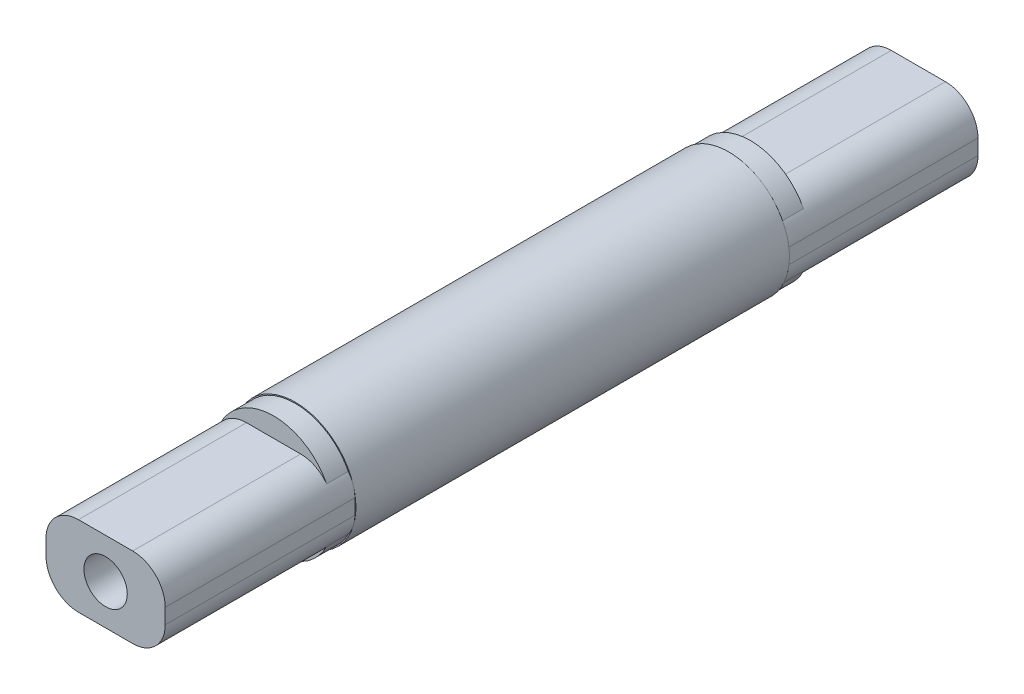
ISO-10303-21;
HEADER;
FILE_DESCRIPTION(('STEP AP214'),'2;1');
FILE_NAME('part.step','',(''),(''),'','','');
FILE_SCHEMA(('AUTOMOTIVE_DESIGN { 1 0 10303 214 1 1 1 1 }'));
ENDSEC;
DATA;
#1=APPLICATION_CONTEXT('core data for automotive mechanical design processes');
#2=APPLICATION_PROTOCOL_DEFINITION('international standard','automotive_design',2000,#1);
#3=PRODUCT_CONTEXT('',#1,'mechanical');
#4=PRODUCT('Part','Part','',(#3));
#5=PRODUCT_RELATED_PRODUCT_CATEGORY('part','',(#4));
#6=PRODUCT_DEFINITION_FORMATION('','',#4);
#7=PRODUCT_DEFINITION_CONTEXT('part definition',#1,'design');
#8=PRODUCT_DEFINITION('design','',#6,#7);
#9=PRODUCT_DEFINITION_SHAPE('','',#8);
#10=(LENGTH_UNIT() NAMED_UNIT(*) SI_UNIT(.MILLI.,.METRE.));
#11=(NAMED_UNIT(*) PLANE_ANGLE_UNIT() SI_UNIT($,.RADIAN.));
#12=(NAMED_UNIT(*) SI_UNIT($,.STERADIAN.) SOLID_ANGLE_UNIT());
#13=UNCERTAINTY_MEASURE_WITH_UNIT(LENGTH_MEASURE(1.E-05),#10,'distance_accuracy_value','');
#14=(GEOMETRIC_REPRESENTATION_CONTEXT(3) GLOBAL_UNCERTAINTY_ASSIGNED_CONTEXT((#13)) GLOBAL_UNIT_ASSIGNED_CONTEXT((#10,
#11,#12)) REPRESENTATION_CONTEXT('',''));
#15=CARTESIAN_POINT('',(0.,0.,0.));
#16=DIRECTION('',(0.,0.,1.));
#17=DIRECTION('',(1.,0.,0.));
#18=AXIS2_PLACEMENT_3D('',#15,#16,#17);
#19=CARTESIAN_POINT('',(0.,7.1,11.));
#20=DIRECTION('',(0.,0.,1.));
#21=DIRECTION('',(1.,0.,0.));
#22=AXIS2_PLACEMENT_3D('',#19,#20,#21);
#23=PLANE('',#22);
#24=CARTESIAN_POINT('',(0.,7.1,11.));
#25=DIRECTION('',(0.,0.,1.));
#26=DIRECTION('',(1.,0.,0.));
#27=AXIS2_PLACEMENT_3D('',#24,#25,#26);
#28=CIRCLE('',#27,1.);
#29=CARTESIAN_POINT('',(1.,7.1,11.));
#30=VERTEX_POINT('',#29);
#31=EDGE_CURVE('E14',#30,#30,#28,.T.);
#32=ORIENTED_EDGE('',*,*,#31,.T.);
#33=EDGE_LOOP('',(#32));
#34=FACE_BOUND('',#33,.T.);
#35=ADVANCED_FACE('F62',(#34),#23,.T.);
#36=CARTESIAN_POINT('',(0.,7.1,18.75));
#37=DIRECTION('',(0.,0.,-1.));
#38=DIRECTION('',(-1.,0.,0.));
#39=AXIS2_PLACEMENT_3D('',#36,#37,#38);
#40=CYLINDRICAL_SURFACE('',#39,1.);
#41=ORIENTED_EDGE('',*,*,#31,.F.);
#42=EDGE_LOOP('',(#41));
#43=FACE_BOUND('',#42,.T.);
#44=CARTESIAN_POINT('',(0.,7.1,18.75));
#45=DIRECTION('',(0.,0.,1.));
#46=DIRECTION('',(1.,0.,0.));
#47=AXIS2_PLACEMENT_3D('',#44,#45,#46);
#48=CIRCLE('',#47,1.);
#49=CARTESIAN_POINT('',(1.,7.1,18.75));
#50=VERTEX_POINT('',#49);
#51=EDGE_CURVE('E342',#50,#50,#48,.T.);
#52=ORIENTED_EDGE('',*,*,#51,.T.);
#53=EDGE_LOOP('',(#52));
#54=FACE_BOUND('',#53,.T.);
#55=ADVANCED_FACE('F657',(#43,#54),#40,.F.);
#56=DIRECTION('',(-1.,0.,0.));
#57=VECTOR('',#56,1.);
#58=CARTESIAN_POINT('',(2.75,8.95,11.));
#59=LINE('',#58,#57);
#60=CARTESIAN_POINT('',(1.25,8.95,11.));
#61=VERTEX_POINT('',#60);
#62=CARTESIAN_POINT('',(-1.25,8.95,11.));
#63=VERTEX_POINT('',#62);
#64=EDGE_CURVE('E549',#61,#63,#59,.T.);
#65=ORIENTED_EDGE('',*,*,#64,.F.);
#66=CARTESIAN_POINT('',(1.25,7.45,11.));
#67=DIRECTION('',(0.,0.,1.));
#68=DIRECTION('',(1.,0.,0.));
#69=AXIS2_PLACEMENT_3D('',#66,#67,#68);
#70=CIRCLE('',#69,1.5);
#71=CARTESIAN_POINT('',(2.44840600314406,8.35212141734263,11.));
#72=VERTEX_POINT('',#71);
#73=EDGE_CURVE('E545',#61,#72,#70,.F.);
#74=ORIENTED_EDGE('',*,*,#73,.T.);
#75=CARTESIAN_POINT('',(0.,7.1,11.));
#76=DIRECTION('',(0.,0.,1.));
#77=DIRECTION('',(1.,0.,0.));
#78=AXIS2_PLACEMENT_3D('',#75,#76,#77);
#79=CIRCLE('',#78,2.75);
#80=CARTESIAN_POINT('',(-2.44840600314406,8.35212141734262,11.));
#81=VERTEX_POINT('',#80);
#82=EDGE_CURVE('E553',#72,#81,#79,.T.);
#83=ORIENTED_EDGE('',*,*,#82,.T.);
#84=CARTESIAN_POINT('',(-1.25,7.45,11.));
#85=DIRECTION('',(0.,0.,1.));
#86=DIRECTION('',(1.,0.,0.));
#87=AXIS2_PLACEMENT_3D('',#84,#85,#86);
#88=CIRCLE('',#87,1.5);
#89=EDGE_CURVE('E283',#81,#63,#88,.F.);
#90=ORIENTED_EDGE('',*,*,#89,.T.);
#91=EDGE_LOOP('',(#65,#74,#83,#90));
#92=FACE_BOUND('',#91,.T.);
#93=ADVANCED_FACE('F661',(#92),#23,.T.);
#94=CARTESIAN_POINT('',(2.75,8.95,18.75));
#95=DIRECTION('',(0.,-1.,0.));
#96=DIRECTION('',(0.,0.,-1.));
#97=AXIS2_PLACEMENT_3D('',#94,#95,#96);
#98=PLANE('',#97);
#99=DIRECTION('',(0.,0.,-1.));
#100=VECTOR('',#99,1.);
#101=CARTESIAN_POINT('',(1.25,8.95,18.75));
#102=LINE('',#101,#100);
#103=CARTESIAN_POINT('',(1.25,8.95,18.75));
#104=VERTEX_POINT('',#103);
#105=EDGE_CURVE('E433',#104,#61,#102,.T.);
#106=ORIENTED_EDGE('',*,*,#105,.T.);
#107=ORIENTED_EDGE('',*,*,#64,.T.);
#108=DIRECTION('',(0.,0.,-1.));
#109=VECTOR('',#108,1.);
#110=CARTESIAN_POINT('',(-1.25,8.95,18.75));
#111=LINE('',#110,#109);
#112=CARTESIAN_POINT('',(-1.25,8.95,18.75));
#113=VERTEX_POINT('',#112);
#114=EDGE_CURVE('E430',#63,#113,#111,.F.);
#115=ORIENTED_EDGE('',*,*,#114,.T.);
#116=DIRECTION('',(-1.,0.,0.));
#117=VECTOR('',#116,1.);
#118=CARTESIAN_POINT('',(2.75,8.95,18.75));
#119=LINE('',#118,#117);
#120=EDGE_CURVE('E363',#104,#113,#119,.T.);
#121=ORIENTED_EDGE('',*,*,#120,.F.);
#122=EDGE_LOOP('',(#106,#107,#115,#121));
#123=FACE_BOUND('',#122,.T.);
#124=ADVANCED_FACE('F672',(#123),#98,.F.);
#125=CARTESIAN_POINT('',(-2.44840600314406,5.84787858265737,11.));
#126=VERTEX_POINT('',#125);
#127=CARTESIAN_POINT('',(2.44840600314406,5.84787858265737,11.));
#128=VERTEX_POINT('',#127);
#129=EDGE_CURVE('E559',#126,#128,#79,.T.);
#130=ORIENTED_EDGE('',*,*,#129,.T.);
#131=CARTESIAN_POINT('',(1.25,6.75,11.));
#132=DIRECTION('',(0.,0.,1.));
#133=DIRECTION('',(1.,0.,0.));
#134=AXIS2_PLACEMENT_3D('',#131,#132,#133);
#135=CIRCLE('',#134,1.5);
#136=CARTESIAN_POINT('',(1.25,5.25,11.));
#137=VERTEX_POINT('',#136);
#138=EDGE_CURVE('E515',#128,#137,#135,.F.);
#139=ORIENTED_EDGE('',*,*,#138,.T.);
#140=DIRECTION('',(1.,0.,0.));
#141=VECTOR('',#140,1.);
#142=CARTESIAN_POINT('',(2.75,5.25,11.));
#143=LINE('',#142,#141);
#144=CARTESIAN_POINT('',(-1.25,5.25,11.));
#145=VERTEX_POINT('',#144);
#146=EDGE_CURVE('E534',#145,#137,#143,.T.);
#147=ORIENTED_EDGE('',*,*,#146,.F.);
#148=CARTESIAN_POINT('',(-1.25,6.75,11.));
#149=DIRECTION('',(0.,0.,1.));
#150=DIRECTION('',(1.,0.,0.));
#151=AXIS2_PLACEMENT_3D('',#148,#149,#150);
#152=CIRCLE('',#151,1.5);
#153=EDGE_CURVE('E539',#145,#126,#152,.F.);
#154=ORIENTED_EDGE('',*,*,#153,.T.);
#155=EDGE_LOOP('',(#130,#139,#147,#154));
#156=FACE_BOUND('',#155,.T.);
#157=ADVANCED_FACE('F660',(#156),#23,.T.);
#158=CARTESIAN_POINT('',(2.75,5.25,18.75));
#159=DIRECTION('',(0.,1.,0.));
#160=DIRECTION('',(-1.,0.,0.));
#161=AXIS2_PLACEMENT_3D('',#158,#159,#160);
#162=PLANE('',#161);
#163=DIRECTION('',(0.,0.,-1.));
#164=VECTOR('',#163,1.);
#165=CARTESIAN_POINT('',(-1.25,5.25,18.75));
#166=LINE('',#165,#164);
#167=CARTESIAN_POINT('',(-1.25,5.25,18.75));
#168=VERTEX_POINT('',#167);
#169=EDGE_CURVE('E456',#168,#145,#166,.T.);
#170=ORIENTED_EDGE('',*,*,#169,.T.);
#171=ORIENTED_EDGE('',*,*,#146,.T.);
#172=DIRECTION('',(0.,0.,-1.));
#173=VECTOR('',#172,1.);
#174=CARTESIAN_POINT('',(1.25,5.25,18.75));
#175=LINE('',#174,#173);
#176=CARTESIAN_POINT('',(1.25,5.25,18.75));
#177=VERTEX_POINT('',#176);
#178=EDGE_CURVE('E460',#137,#177,#175,.F.);
#179=ORIENTED_EDGE('',*,*,#178,.T.);
#180=DIRECTION('',(1.,0.,0.));
#181=VECTOR('',#180,1.);
#182=CARTESIAN_POINT('',(2.75,5.25,18.75));
#183=LINE('',#182,#181);
#184=EDGE_CURVE('E354',#168,#177,#183,.T.);
#185=ORIENTED_EDGE('',*,*,#184,.F.);
#186=EDGE_LOOP('',(#170,#171,#179,#185));
#187=FACE_BOUND('',#186,.T.);
#188=ADVANCED_FACE('F671',(#187),#162,.F.);
#189=CARTESIAN_POINT('',(0.,0.,18.75));
#190=DIRECTION('',(0.,0.,1.));
#191=DIRECTION('',(1.,0.,0.));
#192=AXIS2_PLACEMENT_3D('',#189,#190,#191);
#193=PLANE('',#192);
#194=DIRECTION('',(0.,1.,0.));
#195=VECTOR('',#194,1.);
#196=CARTESIAN_POINT('',(2.75,5.25,18.75));
#197=LINE('',#196,#195);
#198=CARTESIAN_POINT('',(2.75,6.75,18.75));
#199=VERTEX_POINT('',#198);
#200=CARTESIAN_POINT('',(2.75,7.45,18.75));
#201=VERTEX_POINT('',#200);
#202=EDGE_CURVE('E359',#199,#201,#197,.T.);
#203=ORIENTED_EDGE('',*,*,#202,.T.);
#204=CARTESIAN_POINT('',(1.25,7.45,18.75));
#205=DIRECTION('',(0.,0.,1.));
#206=DIRECTION('',(1.,0.,0.));
#207=AXIS2_PLACEMENT_3D('',#204,#205,#206);
#208=CIRCLE('',#207,1.5);
#209=EDGE_CURVE('E453',#201,#104,#208,.T.);
#210=ORIENTED_EDGE('',*,*,#209,.T.);
#211=ORIENTED_EDGE('',*,*,#120,.T.);
#212=CARTESIAN_POINT('',(-1.25,7.45,18.75));
#213=DIRECTION('',(0.,0.,1.));
#214=DIRECTION('',(1.,0.,0.));
#215=AXIS2_PLACEMENT_3D('',#212,#213,#214);
#216=CIRCLE('',#215,1.5);
#217=CARTESIAN_POINT('',(-2.75,7.45,18.75));
#218=VERTEX_POINT('',#217);
#219=EDGE_CURVE('E444',#113,#218,#216,.T.);
#220=ORIENTED_EDGE('',*,*,#219,.T.);
#221=DIRECTION('',(0.,-1.,0.));
#222=VECTOR('',#221,1.);
#223=CARTESIAN_POINT('',(-2.75,5.25,18.75));
#224=LINE('',#223,#222);
#225=CARTESIAN_POINT('',(-2.75,6.75,18.75));
#226=VERTEX_POINT('',#225);
#227=EDGE_CURVE('E350',#218,#226,#224,.T.);
#228=ORIENTED_EDGE('',*,*,#227,.T.);
#229=CARTESIAN_POINT('',(-1.25,6.75,18.75));
#230=DIRECTION('',(0.,0.,1.));
#231=DIRECTION('',(1.,0.,0.));
#232=AXIS2_PLACEMENT_3D('',#229,#230,#231);
#233=CIRCLE('',#232,1.5);
#234=EDGE_CURVE('E447',#226,#168,#233,.T.);
#235=ORIENTED_EDGE('',*,*,#234,.T.);
#236=ORIENTED_EDGE('',*,*,#184,.T.);
#237=CARTESIAN_POINT('',(1.25,6.75,18.75));
#238=DIRECTION('',(0.,0.,1.));
#239=DIRECTION('',(1.,0.,0.));
#240=AXIS2_PLACEMENT_3D('',#237,#238,#239);
#241=CIRCLE('',#240,1.5);
#242=EDGE_CURVE('E450',#177,#199,#241,.T.);
#243=ORIENTED_EDGE('',*,*,#242,.T.);
#244=EDGE_LOOP('',(#203,#210,#211,#220,#228,#235,#236,#243));
#245=FACE_BOUND('',#244,.T.);
#246=ORIENTED_EDGE('',*,*,#51,.F.);
#247=EDGE_LOOP('',(#246));
#248=FACE_BOUND('',#247,.T.);
#249=ADVANCED_FACE('F701',(#245,#248),#193,.T.);
#250=CARTESIAN_POINT('',(1.25,7.45,18.75));
#251=DIRECTION('',(0.,0.,-1.));
#252=DIRECTION('',(-1.,0.,0.));
#253=AXIS2_PLACEMENT_3D('',#250,#251,#252);
#254=CYLINDRICAL_SURFACE('',#253,1.5);
#255=ORIENTED_EDGE('',*,*,#105,.F.);
#256=ORIENTED_EDGE('',*,*,#209,.F.);
#257=DIRECTION('',(0.,0.,-1.));
#258=VECTOR('',#257,1.);
#259=CARTESIAN_POINT('',(2.75,7.45,18.75));
#260=LINE('',#259,#258);
#261=CARTESIAN_POINT('',(2.75,7.45,10.));
#262=VERTEX_POINT('',#261);
#263=EDGE_CURVE('E441',#262,#201,#260,.F.);
#264=ORIENTED_EDGE('',*,*,#263,.F.);
#265=CARTESIAN_POINT('',(1.25,7.45,10.));
#266=DIRECTION('',(0.,0.,1.));
#267=DIRECTION('',(1.,0.,0.));
#268=AXIS2_PLACEMENT_3D('',#265,#266,#267);
#269=CIRCLE('',#268,1.5);
#270=CARTESIAN_POINT('',(2.69444602957127,7.85444488827996,10.));
#271=VERTEX_POINT('',#270);
#272=EDGE_CURVE('E489',#271,#262,#269,.F.);
#273=ORIENTED_EDGE('',*,*,#272,.F.);
#274=CARTESIAN_POINT('',(2.44840600314406,8.35212141734263,10.));
#275=VERTEX_POINT('',#274);
#276=EDGE_CURVE('E263',#275,#271,#269,.F.);
#277=ORIENTED_EDGE('',*,*,#276,.F.);
#278=DIRECTION('',(0.,0.,-1.));
#279=VECTOR('',#278,1.);
#280=CARTESIAN_POINT('',(2.44840600314406,8.35212141734263,0.));
#281=LINE('',#280,#279);
#282=EDGE_CURVE('E528',#275,#72,#281,.F.);
#283=ORIENTED_EDGE('',*,*,#282,.T.);
#284=ORIENTED_EDGE('',*,*,#73,.F.);
#285=EDGE_LOOP('',(#255,#256,#264,#273,#277,#283,#284));
#286=FACE_BOUND('',#285,.T.);
#287=ADVANCED_FACE('F686',(#286),#254,.T.);
#288=CARTESIAN_POINT('',(0.,7.1,11.));
#289=DIRECTION('',(0.,0.,-1.));
#290=DIRECTION('',(-1.,0.,0.));
#291=AXIS2_PLACEMENT_3D('',#288,#289,#290);
#292=CYLINDRICAL_SURFACE('',#291,2.75);
#293=ORIENTED_EDGE('',*,*,#282,.F.);
#294=CARTESIAN_POINT('',(0.,7.1,10.));
#295=DIRECTION('',(0.,0.,1.));
#296=DIRECTION('',(1.,0.,0.));
#297=AXIS2_PLACEMENT_3D('',#294,#295,#296);
#298=CIRCLE('',#297,2.75);
#299=CARTESIAN_POINT('',(-2.44840600314406,8.35212141734262,10.));
#300=VERTEX_POINT('',#299);
#301=EDGE_CURVE('E526',#300,#275,#298,.F.);
#302=ORIENTED_EDGE('',*,*,#301,.F.);
#303=DIRECTION('',(0.,0.,-1.));
#304=VECTOR('',#303,1.);
#305=CARTESIAN_POINT('',(-2.44840600314406,8.35212141734262,0.));
#306=LINE('',#305,#304);
#307=EDGE_CURVE('E274',#81,#300,#306,.T.);
#308=ORIENTED_EDGE('',*,*,#307,.F.);
#309=ORIENTED_EDGE('',*,*,#82,.F.);
#310=EDGE_LOOP('',(#293,#302,#308,#309));
#311=FACE_BOUND('',#310,.T.);
#312=ADVANCED_FACE('F691',(#311),#292,.T.);
#313=CARTESIAN_POINT('',(-1.25,7.45,18.75));
#314=DIRECTION('',(0.,0.,-1.));
#315=DIRECTION('',(-1.,0.,0.));
#316=AXIS2_PLACEMENT_3D('',#313,#314,#315);
#317=CYLINDRICAL_SURFACE('',#316,1.5);
#318=DIRECTION('',(0.,0.,-1.));
#319=VECTOR('',#318,1.);
#320=CARTESIAN_POINT('',(-2.75,7.45,18.75));
#321=LINE('',#320,#319);
#322=CARTESIAN_POINT('',(-2.75,7.45,10.));
#323=VERTEX_POINT('',#322);
#324=EDGE_CURVE('E463',#218,#323,#321,.T.);
#325=ORIENTED_EDGE('',*,*,#324,.F.);
#326=ORIENTED_EDGE('',*,*,#219,.F.);
#327=ORIENTED_EDGE('',*,*,#114,.F.);
#328=ORIENTED_EDGE('',*,*,#89,.F.);
#329=ORIENTED_EDGE('',*,*,#307,.T.);
#330=CARTESIAN_POINT('',(-1.25,7.45,10.));
#331=DIRECTION('',(0.,0.,1.));
#332=DIRECTION('',(1.,0.,0.));
#333=AXIS2_PLACEMENT_3D('',#330,#331,#332);
#334=CIRCLE('',#333,1.5);
#335=CARTESIAN_POINT('',(-2.69444602957127,7.85444488827996,10.));
#336=VERTEX_POINT('',#335);
#337=EDGE_CURVE('E260',#336,#300,#334,.F.);
#338=ORIENTED_EDGE('',*,*,#337,.F.);
#339=EDGE_CURVE('E271',#323,#336,#334,.F.);
#340=ORIENTED_EDGE('',*,*,#339,.F.);
#341=EDGE_LOOP('',(#325,#326,#327,#328,#329,#338,#340));
#342=FACE_BOUND('',#341,.T.);
#343=ADVANCED_FACE('F270',(#342),#317,.T.);
#344=CARTESIAN_POINT('',(-2.75,5.25,18.75));
#345=DIRECTION('',(1.,0.,0.));
#346=DIRECTION('',(0.,0.,-1.));
#347=AXIS2_PLACEMENT_3D('',#344,#345,#346);
#348=PLANE('',#347);
#349=DIRECTION('',(0.,1.,0.));
#350=VECTOR('',#349,1.);
#351=CARTESIAN_POINT('',(-2.75,0.,10.));
#352=LINE('',#351,#350);
#353=CARTESIAN_POINT('',(-2.75,6.75,10.));
#354=VERTEX_POINT('',#353);
#355=EDGE_CURVE('E281',#354,#323,#352,.T.);
#356=ORIENTED_EDGE('',*,*,#355,.F.);
#357=DIRECTION('',(0.,0.,-1.));
#358=VECTOR('',#357,1.);
#359=CARTESIAN_POINT('',(-2.75,6.75,18.75));
#360=LINE('',#359,#358);
#361=EDGE_CURVE('E466',#354,#226,#360,.F.);
#362=ORIENTED_EDGE('',*,*,#361,.T.);
#363=ORIENTED_EDGE('',*,*,#227,.F.);
#364=ORIENTED_EDGE('',*,*,#324,.T.);
#365=EDGE_LOOP('',(#356,#362,#363,#364));
#366=FACE_BOUND('',#365,.T.);
#367=ADVANCED_FACE('F649',(#366),#348,.F.);
#368=CARTESIAN_POINT('',(11.25,-29.75,10.));
#369=DIRECTION('',(0.,0.,-1.));
#370=DIRECTION('',(-1.,0.,0.));
#371=AXIS2_PLACEMENT_3D('',#368,#369,#370);
#372=PLANE('',#371);
#373=CARTESIAN_POINT('',(0.,7.1,10.));
#374=DIRECTION('',(0.,0.,-1.));
#375=DIRECTION('',(-1.,0.,0.));
#376=AXIS2_PLACEMENT_3D('',#373,#374,#375);
#377=CIRCLE('',#376,2.79807549857472);
#378=CARTESIAN_POINT('',(-2.69444602957127,6.34555511172004,10.));
#379=VERTEX_POINT('',#378);
#380=EDGE_CURVE('E246',#379,#336,#377,.T.);
#381=ORIENTED_EDGE('',*,*,#380,.F.);
#382=CARTESIAN_POINT('',(-1.25,6.75,10.));
#383=DIRECTION('',(0.,0.,1.));
#384=DIRECTION('',(1.,0.,0.));
#385=AXIS2_PLACEMENT_3D('',#382,#383,#384);
#386=CIRCLE('',#385,1.5);
#387=EDGE_CURVE('E495',#379,#354,#386,.F.);
#388=ORIENTED_EDGE('',*,*,#387,.T.);
#389=ORIENTED_EDGE('',*,*,#355,.T.);
#390=ORIENTED_EDGE('',*,*,#339,.T.);
#391=EDGE_LOOP('',(#381,#388,#389,#390));
#392=FACE_BOUND('',#391,.T.);
#393=ADVANCED_FACE('F279',(#392),#372,.F.);
#394=CARTESIAN_POINT('',(-1.25,6.75,18.75));
#395=DIRECTION('',(0.,0.,-1.));
#396=DIRECTION('',(-1.,0.,0.));
#397=AXIS2_PLACEMENT_3D('',#394,#395,#396);
#398=CYLINDRICAL_SURFACE('',#397,1.5);
#399=ORIENTED_EDGE('',*,*,#169,.F.);
#400=ORIENTED_EDGE('',*,*,#234,.F.);
#401=ORIENTED_EDGE('',*,*,#361,.F.);
#402=ORIENTED_EDGE('',*,*,#387,.F.);
#403=CARTESIAN_POINT('',(-2.44840600314406,5.84787858265737,10.));
#404=VERTEX_POINT('',#403);
#405=EDGE_CURVE('E277',#404,#379,#386,.F.);
#406=ORIENTED_EDGE('',*,*,#405,.F.);
#407=DIRECTION('',(0.,0.,-1.));
#408=VECTOR('',#407,1.);
#409=CARTESIAN_POINT('',(-2.44840600314406,5.84787858265737,0.));
#410=LINE('',#409,#408);
#411=EDGE_CURVE('E523',#404,#126,#410,.F.);
#412=ORIENTED_EDGE('',*,*,#411,.T.);
#413=ORIENTED_EDGE('',*,*,#153,.F.);
#414=EDGE_LOOP('',(#399,#400,#401,#402,#406,#412,#413));
#415=FACE_BOUND('',#414,.T.);
#416=ADVANCED_FACE('F706',(#415),#398,.T.);
#417=DIRECTION('',(0.,0.,-1.));
#418=VECTOR('',#417,1.);
#419=CARTESIAN_POINT('',(2.44840600314406,5.84787858265737,0.));
#420=LINE('',#419,#418);
#421=CARTESIAN_POINT('',(2.44840600314406,5.84787858265737,10.));
#422=VERTEX_POINT('',#421);
#423=EDGE_CURVE('E510',#128,#422,#420,.T.);
#424=ORIENTED_EDGE('',*,*,#423,.F.);
#425=ORIENTED_EDGE('',*,*,#129,.F.);
#426=ORIENTED_EDGE('',*,*,#411,.F.);
#427=EDGE_CURVE('E506',#422,#404,#298,.F.);
#428=ORIENTED_EDGE('',*,*,#427,.F.);
#429=EDGE_LOOP('',(#424,#425,#426,#428));
#430=FACE_BOUND('',#429,.T.);
#431=ADVANCED_FACE('F522',(#430),#292,.T.);
#432=CARTESIAN_POINT('',(2.69444602957127,6.34555511172004,10.));
#433=VERTEX_POINT('',#432);
#434=EDGE_CURVE('E87',#433,#379,#377,.T.);
#435=ORIENTED_EDGE('',*,*,#434,.F.);
#436=CARTESIAN_POINT('',(1.25,6.75,10.));
#437=DIRECTION('',(0.,0.,1.));
#438=DIRECTION('',(1.,0.,0.));
#439=AXIS2_PLACEMENT_3D('',#436,#437,#438);
#440=CIRCLE('',#439,1.5);
#441=EDGE_CURVE('E491',#433,#422,#440,.F.);
#442=ORIENTED_EDGE('',*,*,#441,.T.);
#443=ORIENTED_EDGE('',*,*,#427,.T.);
#444=ORIENTED_EDGE('',*,*,#405,.T.);
#445=EDGE_LOOP('',(#435,#442,#443,#444));
#446=FACE_BOUND('',#445,.T.);
#447=ADVANCED_FACE('F503',(#446),#372,.F.);
#448=CARTESIAN_POINT('',(1.25,6.75,18.75));
#449=DIRECTION('',(0.,0.,-1.));
#450=DIRECTION('',(-1.,0.,0.));
#451=AXIS2_PLACEMENT_3D('',#448,#449,#450);
#452=CYLINDRICAL_SURFACE('',#451,1.5);
#453=DIRECTION('',(0.,0.,-1.));
#454=VECTOR('',#453,1.);
#455=CARTESIAN_POINT('',(2.75,6.75,18.75));
#456=LINE('',#455,#454);
#457=CARTESIAN_POINT('',(2.75,6.75,10.));
#458=VERTEX_POINT('',#457);
#459=EDGE_CURVE('E437',#199,#458,#456,.T.);
#460=ORIENTED_EDGE('',*,*,#459,.F.);
#461=ORIENTED_EDGE('',*,*,#242,.F.);
#462=ORIENTED_EDGE('',*,*,#178,.F.);
#463=ORIENTED_EDGE('',*,*,#138,.F.);
#464=ORIENTED_EDGE('',*,*,#423,.T.);
#465=ORIENTED_EDGE('',*,*,#441,.F.);
#466=EDGE_CURVE('E492',#458,#433,#440,.F.);
#467=ORIENTED_EDGE('',*,*,#466,.F.);
#468=EDGE_LOOP('',(#460,#461,#462,#463,#464,#465,#467));
#469=FACE_BOUND('',#468,.T.);
#470=ADVANCED_FACE('F512',(#469),#452,.T.);
#471=CARTESIAN_POINT('',(2.75,5.25,18.75));
#472=DIRECTION('',(-1.,0.,0.));
#473=DIRECTION('',(0.,0.,1.));
#474=AXIS2_PLACEMENT_3D('',#471,#472,#473);
#475=PLANE('',#474);
#476=DIRECTION('',(0.,-1.,0.));
#477=VECTOR('',#476,1.);
#478=CARTESIAN_POINT('',(2.75,0.,10.));
#479=LINE('',#478,#477);
#480=EDGE_CURVE('E367',#262,#458,#479,.T.);
#481=ORIENTED_EDGE('',*,*,#480,.F.);
#482=ORIENTED_EDGE('',*,*,#263,.T.);
#483=ORIENTED_EDGE('',*,*,#202,.F.);
#484=ORIENTED_EDGE('',*,*,#459,.T.);
#485=EDGE_LOOP('',(#481,#482,#483,#484));
#486=FACE_BOUND('',#485,.T.);
#487=ADVANCED_FACE('F643',(#486),#475,.F.);
#488=EDGE_CURVE('E266',#271,#433,#377,.T.);
#489=ORIENTED_EDGE('',*,*,#488,.F.);
#490=ORIENTED_EDGE('',*,*,#272,.T.);
#491=ORIENTED_EDGE('',*,*,#480,.T.);
#492=ORIENTED_EDGE('',*,*,#466,.T.);
#493=EDGE_LOOP('',(#489,#490,#491,#492));
#494=FACE_BOUND('',#493,.T.);
#495=ADVANCED_FACE('F654',(#494),#372,.F.);
#496=EDGE_CURVE('E249',#336,#271,#377,.T.);
#497=ORIENTED_EDGE('',*,*,#496,.F.);
#498=ORIENTED_EDGE('',*,*,#337,.T.);
#499=ORIENTED_EDGE('',*,*,#301,.T.);
#500=ORIENTED_EDGE('',*,*,#276,.T.);
#501=EDGE_LOOP('',(#497,#498,#499,#500));
#502=FACE_BOUND('',#501,.T.);
#503=ADVANCED_FACE('F259',(#502),#372,.F.);
#504=CARTESIAN_POINT('',(0.,7.1,-40.25));
#505=DIRECTION('',(0.,0.,1.));
#506=DIRECTION('',(1.,0.,0.));
#507=AXIS2_PLACEMENT_3D('',#504,#505,#506);
#508=CYLINDRICAL_SURFACE('',#507,2.79807549857472);
#509=ORIENTED_EDGE('',*,*,#496,.T.);
#510=ORIENTED_EDGE('',*,*,#488,.T.);
#511=ORIENTED_EDGE('',*,*,#434,.T.);
#512=ORIENTED_EDGE('',*,*,#380,.T.);
#513=EDGE_LOOP('',(#509,#510,#511,#512));
#514=FACE_BOUND('',#513,.T.);
#515=CARTESIAN_POINT('',(0.,7.1,-10.));
#516=DIRECTION('',(0.,0.,1.));
#517=DIRECTION('',(1.,0.,0.));
#518=AXIS2_PLACEMENT_3D('',#515,#516,#517);
#519=CIRCLE('',#518,2.79807549857472);
#520=CARTESIAN_POINT('',(2.69444602957127,7.85444488827996,-10.));
#521=VERTEX_POINT('',#520);
#522=CARTESIAN_POINT('',(-2.69444602957127,7.85444488827996,-9.99999999999999));
#523=VERTEX_POINT('',#522);
#524=EDGE_CURVE('E558',#521,#523,#519,.T.);
#525=ORIENTED_EDGE('',*,*,#524,.T.);
#526=CARTESIAN_POINT('',(-2.69444602957127,6.34555511172004,-9.99999999999999));
#527=VERTEX_POINT('',#526);
#528=EDGE_CURVE('E565',#523,#527,#519,.T.);
#529=ORIENTED_EDGE('',*,*,#528,.T.);
#530=CARTESIAN_POINT('',(2.69444602957127,6.34555511172004,-10.));
#531=VERTEX_POINT('',#530);
#532=EDGE_CURVE('E79',#527,#531,#519,.T.);
#533=ORIENTED_EDGE('',*,*,#532,.T.);
#534=EDGE_CURVE('E265',#531,#521,#519,.T.);
#535=ORIENTED_EDGE('',*,*,#534,.T.);
#536=EDGE_LOOP('',(#525,#529,#533,#535));
#537=FACE_BOUND('',#536,.T.);
#538=ADVANCED_FACE('F248',(#514,#537),#508,.T.);
#539=CARTESIAN_POINT('',(-11.25,-29.75,-10.));
#540=DIRECTION('',(0.,0.,1.));
#541=DIRECTION('',(1.,0.,0.));
#542=AXIS2_PLACEMENT_3D('',#539,#540,#541);
#543=PLANE('',#542);
#544=ORIENTED_EDGE('',*,*,#524,.F.);
#545=CARTESIAN_POINT('',(1.25,7.45,-10.));
#546=DIRECTION('',(0.,0.,1.));
#547=DIRECTION('',(1.,0.,0.));
#548=AXIS2_PLACEMENT_3D('',#545,#546,#547);
#549=CIRCLE('',#548,1.5);
#550=CARTESIAN_POINT('',(2.44840600314406,8.35212141734263,-10.));
#551=VERTEX_POINT('',#550);
#552=EDGE_CURVE('E484',#521,#551,#549,.T.);
#553=ORIENTED_EDGE('',*,*,#552,.T.);
#554=CARTESIAN_POINT('',(0.,7.1,-10.));
#555=DIRECTION('',(0.,0.,1.));
#556=DIRECTION('',(1.,0.,0.));
#557=AXIS2_PLACEMENT_3D('',#554,#555,#556);
#558=CIRCLE('',#557,2.75);
#559=CARTESIAN_POINT('',(-2.44840600314406,8.35212141734262,-10.));
#560=VERTEX_POINT('',#559);
#561=EDGE_CURVE('E616',#560,#551,#558,.F.);
#562=ORIENTED_EDGE('',*,*,#561,.F.);
#563=CARTESIAN_POINT('',(-1.25,7.45,-10.));
#564=DIRECTION('',(0.,0.,1.));
#565=DIRECTION('',(1.,0.,0.));
#566=AXIS2_PLACEMENT_3D('',#563,#564,#565);
#567=CIRCLE('',#566,1.5);
#568=EDGE_CURVE('E475',#560,#523,#567,.T.);
#569=ORIENTED_EDGE('',*,*,#568,.T.);
#570=EDGE_LOOP('',(#544,#553,#562,#569));
#571=FACE_BOUND('',#570,.T.);
#572=ADVANCED_FACE('F64',(#571),#543,.F.);
#573=ORIENTED_EDGE('',*,*,#528,.F.);
#574=CARTESIAN_POINT('',(-2.75,7.45,-10.));
#575=VERTEX_POINT('',#574);
#576=EDGE_CURVE('E474',#523,#575,#567,.T.);
#577=ORIENTED_EDGE('',*,*,#576,.T.);
#578=DIRECTION('',(0.,1.,0.));
#579=VECTOR('',#578,1.);
#580=CARTESIAN_POINT('',(-2.75,0.,-10.));
#581=LINE('',#580,#579);
#582=CARTESIAN_POINT('',(-2.75,6.75,-10.));
#583=VERTEX_POINT('',#582);
#584=EDGE_CURVE('E389',#583,#575,#581,.T.);
#585=ORIENTED_EDGE('',*,*,#584,.F.);
#586=CARTESIAN_POINT('',(-1.25,6.75,-10.));
#587=DIRECTION('',(0.,0.,1.));
#588=DIRECTION('',(1.,0.,0.));
#589=AXIS2_PLACEMENT_3D('',#586,#587,#588);
#590=CIRCLE('',#589,1.5);
#591=EDGE_CURVE('E470',#583,#527,#590,.T.);
#592=ORIENTED_EDGE('',*,*,#591,.T.);
#593=EDGE_LOOP('',(#573,#577,#585,#592));
#594=FACE_BOUND('',#593,.T.);
#595=ADVANCED_FACE('F583',(#594),#543,.F.);
#596=ORIENTED_EDGE('',*,*,#532,.F.);
#597=CARTESIAN_POINT('',(-2.44840600314406,5.84787858265737,-10.));
#598=VERTEX_POINT('',#597);
#599=EDGE_CURVE('E469',#527,#598,#590,.T.);
#600=ORIENTED_EDGE('',*,*,#599,.T.);
#601=CARTESIAN_POINT('',(2.44840600314406,5.84787858265737,-10.));
#602=VERTEX_POINT('',#601);
#603=EDGE_CURVE('E323',#602,#598,#558,.F.);
#604=ORIENTED_EDGE('',*,*,#603,.F.);
#605=CARTESIAN_POINT('',(1.25,6.75,-10.));
#606=DIRECTION('',(0.,0.,1.));
#607=DIRECTION('',(1.,0.,0.));
#608=AXIS2_PLACEMENT_3D('',#605,#606,#607);
#609=CIRCLE('',#608,1.5);
#610=EDGE_CURVE('E480',#602,#531,#609,.T.);
#611=ORIENTED_EDGE('',*,*,#610,.T.);
#612=EDGE_LOOP('',(#596,#600,#604,#611));
#613=FACE_BOUND('',#612,.T.);
#614=ADVANCED_FACE('F573',(#613),#543,.F.);
#615=ORIENTED_EDGE('',*,*,#534,.F.);
#616=CARTESIAN_POINT('',(2.75,6.75,-10.));
#617=VERTEX_POINT('',#616);
#618=EDGE_CURVE('E479',#531,#617,#609,.T.);
#619=ORIENTED_EDGE('',*,*,#618,.T.);
#620=DIRECTION('',(0.,-1.,0.));
#621=VECTOR('',#620,1.);
#622=CARTESIAN_POINT('',(2.75,0.,-10.));
#623=LINE('',#622,#621);
#624=CARTESIAN_POINT('',(2.75,7.45,-10.));
#625=VERTEX_POINT('',#624);
#626=EDGE_CURVE('E385',#625,#617,#623,.T.);
#627=ORIENTED_EDGE('',*,*,#626,.F.);
#628=EDGE_CURVE('E485',#625,#521,#549,.T.);
#629=ORIENTED_EDGE('',*,*,#628,.T.);
#630=EDGE_LOOP('',(#615,#619,#627,#629));
#631=FACE_BOUND('',#630,.T.);
#632=ADVANCED_FACE('F637',(#631),#543,.F.);
#633=DIRECTION('',(-1.,0.,0.));
#634=VECTOR('',#633,1.);
#635=CARTESIAN_POINT('',(2.75,8.95,-11.));
#636=LINE('',#635,#634);
#637=CARTESIAN_POINT('',(1.25,8.95,-11.));
#638=VERTEX_POINT('',#637);
#639=CARTESIAN_POINT('',(-1.25,8.95,-11.));
#640=VERTEX_POINT('',#639);
#641=EDGE_CURVE('E304',#638,#640,#636,.T.);
#642=ORIENTED_EDGE('',*,*,#641,.F.);
#643=DIRECTION('',(0.,0.,-1.));
#644=VECTOR('',#643,1.);
#645=CARTESIAN_POINT('',(1.25,8.95,18.75));
#646=LINE('',#645,#644);
#647=CARTESIAN_POINT('',(1.25,8.95,-18.75));
#648=VERTEX_POINT('',#647);
#649=EDGE_CURVE('E300',#638,#648,#646,.T.);
#650=ORIENTED_EDGE('',*,*,#649,.T.);
#651=DIRECTION('',(-1.,0.,0.));
#652=VECTOR('',#651,1.);
#653=CARTESIAN_POINT('',(2.75,8.95,-18.75));
#654=LINE('',#653,#652);
#655=CARTESIAN_POINT('',(-1.25,8.95,-18.75));
#656=VERTEX_POINT('',#655);
#657=EDGE_CURVE('E355',#648,#656,#654,.T.);
#658=ORIENTED_EDGE('',*,*,#657,.T.);
#659=DIRECTION('',(0.,0.,-1.));
#660=VECTOR('',#659,1.);
#661=CARTESIAN_POINT('',(-1.25,8.95,18.75));
#662=LINE('',#661,#660);
#663=EDGE_CURVE('E313',#656,#640,#662,.F.);
#664=ORIENTED_EDGE('',*,*,#663,.T.);
#665=EDGE_LOOP('',(#642,#650,#658,#664));
#666=FACE_BOUND('',#665,.T.);
#667=ADVANCED_FACE('F310',(#666),#98,.F.);
#668=DIRECTION('',(1.,0.,0.));
#669=VECTOR('',#668,1.);
#670=CARTESIAN_POINT('',(2.75,5.25,-11.));
#671=LINE('',#670,#669);
#672=CARTESIAN_POINT('',(-1.25,5.25,-11.));
#673=VERTEX_POINT('',#672);
#674=CARTESIAN_POINT('',(1.25,5.25,-11.));
#675=VERTEX_POINT('',#674);
#676=EDGE_CURVE('E330',#673,#675,#671,.T.);
#677=ORIENTED_EDGE('',*,*,#676,.F.);
#678=DIRECTION('',(0.,0.,-1.));
#679=VECTOR('',#678,1.);
#680=CARTESIAN_POINT('',(-1.25,5.25,18.75));
#681=LINE('',#680,#679);
#682=CARTESIAN_POINT('',(-1.25,5.25,-18.75));
#683=VERTEX_POINT('',#682);
#684=EDGE_CURVE('E397',#673,#683,#681,.T.);
#685=ORIENTED_EDGE('',*,*,#684,.T.);
#686=DIRECTION('',(1.,0.,0.));
#687=VECTOR('',#686,1.);
#688=CARTESIAN_POINT('',(2.75,5.25,-18.75));
#689=LINE('',#688,#687);
#690=CARTESIAN_POINT('',(1.25,5.25,-18.75));
#691=VERTEX_POINT('',#690);
#692=EDGE_CURVE('E371',#683,#691,#689,.T.);
#693=ORIENTED_EDGE('',*,*,#692,.T.);
#694=DIRECTION('',(0.,0.,-1.));
#695=VECTOR('',#694,1.);
#696=CARTESIAN_POINT('',(1.25,5.25,18.75));
#697=LINE('',#696,#695);
#698=EDGE_CURVE('E393',#691,#675,#697,.F.);
#699=ORIENTED_EDGE('',*,*,#698,.T.);
#700=EDGE_LOOP('',(#677,#685,#693,#699));
#701=FACE_BOUND('',#700,.T.);
#702=ADVANCED_FACE('F602',(#701),#162,.F.);
#703=CARTESIAN_POINT('',(0.,7.1,-18.75));
#704=DIRECTION('',(0.,0.,1.));
#705=DIRECTION('',(1.,0.,0.));
#706=AXIS2_PLACEMENT_3D('',#703,#704,#705);
#707=CIRCLE('',#706,1.);
#708=CARTESIAN_POINT('',(1.,7.1,-18.75));
#709=VERTEX_POINT('',#708);
#710=EDGE_CURVE('E341',#709,#709,#707,.T.);
#711=ORIENTED_EDGE('',*,*,#710,.F.);
#712=EDGE_LOOP('',(#711));
#713=FACE_BOUND('',#712,.T.);
#714=CARTESIAN_POINT('',(0.,7.1,-11.));
#715=DIRECTION('',(0.,0.,1.));
#716=DIRECTION('',(1.,0.,0.));
#717=AXIS2_PLACEMENT_3D('',#714,#715,#716);
#718=CIRCLE('',#717,1.);
#719=CARTESIAN_POINT('',(1.,7.1,-11.));
#720=VERTEX_POINT('',#719);
#721=EDGE_CURVE('E337',#720,#720,#718,.T.);
#722=ORIENTED_EDGE('',*,*,#721,.T.);
#723=EDGE_LOOP('',(#722));
#724=FACE_BOUND('',#723,.T.);
#725=ADVANCED_FACE('F667',(#713,#724),#40,.F.);
#726=CARTESIAN_POINT('',(-1.25,6.75,18.75));
#727=DIRECTION('',(0.,0.,-1.));
#728=DIRECTION('',(-1.,0.,0.));
#729=AXIS2_PLACEMENT_3D('',#726,#727,#728);
#730=CYLINDRICAL_SURFACE('',#729,1.5);
#731=ORIENTED_EDGE('',*,*,#599,.F.);
#732=ORIENTED_EDGE('',*,*,#591,.F.);
#733=DIRECTION('',(0.,0.,-1.));
#734=VECTOR('',#733,1.);
#735=CARTESIAN_POINT('',(-2.75,6.75,18.75));
#736=LINE('',#735,#734);
#737=CARTESIAN_POINT('',(-2.75,6.75,-18.75));
#738=VERTEX_POINT('',#737);
#739=EDGE_CURVE('E416',#738,#583,#736,.F.);
#740=ORIENTED_EDGE('',*,*,#739,.F.);
#741=CARTESIAN_POINT('',(-1.25,6.75,-18.75));
#742=DIRECTION('',(0.,0.,1.));
#743=DIRECTION('',(1.,0.,0.));
#744=AXIS2_PLACEMENT_3D('',#741,#742,#743);
#745=CIRCLE('',#744,1.5);
#746=EDGE_CURVE('E409',#683,#738,#745,.F.);
#747=ORIENTED_EDGE('',*,*,#746,.F.);
#748=ORIENTED_EDGE('',*,*,#684,.F.);
#749=CARTESIAN_POINT('',(-1.25,6.75,-11.));
#750=DIRECTION('',(0.,0.,1.));
#751=DIRECTION('',(1.,0.,0.));
#752=AXIS2_PLACEMENT_3D('',#749,#750,#751);
#753=CIRCLE('',#752,1.5);
#754=CARTESIAN_POINT('',(-2.44840600314406,5.84787858265737,-11.));
#755=VERTEX_POINT('',#754);
#756=EDGE_CURVE('E333',#673,#755,#753,.F.);
#757=ORIENTED_EDGE('',*,*,#756,.T.);
#758=DIRECTION('',(0.,0.,-1.));
#759=VECTOR('',#758,1.);
#760=CARTESIAN_POINT('',(-2.44840600314406,5.84787858265737,0.));
#761=LINE('',#760,#759);
#762=EDGE_CURVE('E316',#755,#598,#761,.F.);
#763=ORIENTED_EDGE('',*,*,#762,.T.);
#764=EDGE_LOOP('',(#731,#732,#740,#747,#748,#757,#763));
#765=FACE_BOUND('',#764,.T.);
#766=ADVANCED_FACE('F579',(#765),#730,.T.);
#767=CARTESIAN_POINT('',(-1.25,7.45,18.75));
#768=DIRECTION('',(0.,0.,-1.));
#769=DIRECTION('',(-1.,0.,0.));
#770=AXIS2_PLACEMENT_3D('',#767,#768,#769);
#771=CYLINDRICAL_SURFACE('',#770,1.5);
#772=ORIENTED_EDGE('',*,*,#576,.F.);
#773=ORIENTED_EDGE('',*,*,#568,.F.);
#774=DIRECTION('',(0.,0.,-1.));
#775=VECTOR('',#774,1.);
#776=CARTESIAN_POINT('',(-2.44840600314406,8.35212141734262,0.));
#777=LINE('',#776,#775);
#778=CARTESIAN_POINT('',(-2.44840600314406,8.35212141734262,-11.));
#779=VERTEX_POINT('',#778);
#780=EDGE_CURVE('E618',#560,#779,#777,.T.);
#781=ORIENTED_EDGE('',*,*,#780,.T.);
#782=CARTESIAN_POINT('',(-1.25,7.45,-11.));
#783=DIRECTION('',(0.,0.,1.));
#784=DIRECTION('',(1.,0.,0.));
#785=AXIS2_PLACEMENT_3D('',#782,#783,#784);
#786=CIRCLE('',#785,1.5);
#787=EDGE_CURVE('E315',#779,#640,#786,.F.);
#788=ORIENTED_EDGE('',*,*,#787,.T.);
#789=ORIENTED_EDGE('',*,*,#663,.F.);
#790=CARTESIAN_POINT('',(-1.25,7.45,-18.75));
#791=DIRECTION('',(0.,0.,1.));
#792=DIRECTION('',(1.,0.,0.));
#793=AXIS2_PLACEMENT_3D('',#790,#791,#792);
#794=CIRCLE('',#793,1.5);
#795=CARTESIAN_POINT('',(-2.75,7.45,-18.75));
#796=VERTEX_POINT('',#795);
#797=EDGE_CURVE('E406',#796,#656,#794,.F.);
#798=ORIENTED_EDGE('',*,*,#797,.F.);
#799=DIRECTION('',(0.,0.,-1.));
#800=VECTOR('',#799,1.);
#801=CARTESIAN_POINT('',(-2.75,7.45,18.75));
#802=LINE('',#801,#800);
#803=EDGE_CURVE('E412',#575,#796,#802,.T.);
#804=ORIENTED_EDGE('',*,*,#803,.F.);
#805=EDGE_LOOP('',(#772,#773,#781,#788,#789,#798,#804));
#806=FACE_BOUND('',#805,.T.);
#807=ADVANCED_FACE('F589',(#806),#771,.T.);
#808=CARTESIAN_POINT('',(1.25,6.75,18.75));
#809=DIRECTION('',(0.,0.,-1.));
#810=DIRECTION('',(-1.,0.,0.));
#811=AXIS2_PLACEMENT_3D('',#808,#809,#810);
#812=CYLINDRICAL_SURFACE('',#811,1.5);
#813=ORIENTED_EDGE('',*,*,#618,.F.);
#814=ORIENTED_EDGE('',*,*,#610,.F.);
#815=DIRECTION('',(0.,0.,-1.));
#816=VECTOR('',#815,1.);
#817=CARTESIAN_POINT('',(2.44840600314406,5.84787858265737,0.));
#818=LINE('',#817,#816);
#819=CARTESIAN_POINT('',(2.44840600314406,5.84787858265737,-11.));
#820=VERTEX_POINT('',#819);
#821=EDGE_CURVE('E608',#602,#820,#818,.T.);
#822=ORIENTED_EDGE('',*,*,#821,.T.);
#823=CARTESIAN_POINT('',(1.25,6.75,-11.));
#824=DIRECTION('',(0.,0.,1.));
#825=DIRECTION('',(1.,0.,0.));
#826=AXIS2_PLACEMENT_3D('',#823,#824,#825);
#827=CIRCLE('',#826,1.5);
#828=EDGE_CURVE('E320',#820,#675,#827,.F.);
#829=ORIENTED_EDGE('',*,*,#828,.T.);
#830=ORIENTED_EDGE('',*,*,#698,.F.);
#831=CARTESIAN_POINT('',(1.25,6.75,-18.75));
#832=DIRECTION('',(0.,0.,1.));
#833=DIRECTION('',(1.,0.,0.));
#834=AXIS2_PLACEMENT_3D('',#831,#832,#833);
#835=CIRCLE('',#834,1.5);
#836=CARTESIAN_POINT('',(2.75,6.75,-18.75));
#837=VERTEX_POINT('',#836);
#838=EDGE_CURVE('E403',#837,#691,#835,.F.);
#839=ORIENTED_EDGE('',*,*,#838,.F.);
#840=DIRECTION('',(0.,0.,-1.));
#841=VECTOR('',#840,1.);
#842=CARTESIAN_POINT('',(2.75,6.75,18.75));
#843=LINE('',#842,#841);
#844=EDGE_CURVE('E426',#617,#837,#843,.T.);
#845=ORIENTED_EDGE('',*,*,#844,.F.);
#846=EDGE_LOOP('',(#813,#814,#822,#829,#830,#839,#845));
#847=FACE_BOUND('',#846,.T.);
#848=ADVANCED_FACE('F605',(#847),#812,.T.);
#849=CARTESIAN_POINT('',(1.25,7.45,18.75));
#850=DIRECTION('',(0.,0.,-1.));
#851=DIRECTION('',(-1.,0.,0.));
#852=AXIS2_PLACEMENT_3D('',#849,#850,#851);
#853=CYLINDRICAL_SURFACE('',#852,1.5);
#854=ORIENTED_EDGE('',*,*,#552,.F.);
#855=ORIENTED_EDGE('',*,*,#628,.F.);
#856=DIRECTION('',(0.,0.,-1.));
#857=VECTOR('',#856,1.);
#858=CARTESIAN_POINT('',(2.75,7.45,18.75));
#859=LINE('',#858,#857);
#860=CARTESIAN_POINT('',(2.75,7.45,-18.75));
#861=VERTEX_POINT('',#860);
#862=EDGE_CURVE('E423',#861,#625,#859,.F.);
#863=ORIENTED_EDGE('',*,*,#862,.F.);
#864=CARTESIAN_POINT('',(1.25,7.45,-18.75));
#865=DIRECTION('',(0.,0.,1.));
#866=DIRECTION('',(1.,0.,0.));
#867=AXIS2_PLACEMENT_3D('',#864,#865,#866);
#868=CIRCLE('',#867,1.5);
#869=EDGE_CURVE('E400',#648,#861,#868,.F.);
#870=ORIENTED_EDGE('',*,*,#869,.F.);
#871=ORIENTED_EDGE('',*,*,#649,.F.);
#872=CARTESIAN_POINT('',(1.25,7.45,-11.));
#873=DIRECTION('',(0.,0.,1.));
#874=DIRECTION('',(1.,0.,0.));
#875=AXIS2_PLACEMENT_3D('',#872,#873,#874);
#876=CIRCLE('',#875,1.5);
#877=CARTESIAN_POINT('',(2.44840600314406,8.35212141734263,-11.));
#878=VERTEX_POINT('',#877);
#879=EDGE_CURVE('E66',#638,#878,#876,.F.);
#880=ORIENTED_EDGE('',*,*,#879,.T.);
#881=DIRECTION('',(0.,0.,-1.));
#882=VECTOR('',#881,1.);
#883=CARTESIAN_POINT('',(2.44840600314406,8.35212141734263,0.));
#884=LINE('',#883,#882);
#885=EDGE_CURVE('E298',#878,#551,#884,.F.);
#886=ORIENTED_EDGE('',*,*,#885,.T.);
#887=EDGE_LOOP('',(#854,#855,#863,#870,#871,#880,#886));
#888=FACE_BOUND('',#887,.T.);
#889=ADVANCED_FACE('F296',(#888),#853,.T.);
#890=ORIENTED_EDGE('',*,*,#626,.T.);
#891=ORIENTED_EDGE('',*,*,#844,.T.);
#892=DIRECTION('',(0.,1.,0.));
#893=VECTOR('',#892,1.);
#894=CARTESIAN_POINT('',(2.75,5.25,-18.75));
#895=LINE('',#894,#893);
#896=EDGE_CURVE('E375',#837,#861,#895,.T.);
#897=ORIENTED_EDGE('',*,*,#896,.T.);
#898=ORIENTED_EDGE('',*,*,#862,.T.);
#899=EDGE_LOOP('',(#890,#891,#897,#898));
#900=FACE_BOUND('',#899,.T.);
#901=ADVANCED_FACE('F639',(#900),#475,.F.);
#902=ORIENTED_EDGE('',*,*,#584,.T.);
#903=ORIENTED_EDGE('',*,*,#803,.T.);
#904=DIRECTION('',(0.,-1.,0.));
#905=VECTOR('',#904,1.);
#906=CARTESIAN_POINT('',(-2.75,5.25,-18.75));
#907=LINE('',#906,#905);
#908=EDGE_CURVE('E346',#796,#738,#907,.T.);
#909=ORIENTED_EDGE('',*,*,#908,.T.);
#910=ORIENTED_EDGE('',*,*,#739,.T.);
#911=EDGE_LOOP('',(#902,#903,#909,#910));
#912=FACE_BOUND('',#911,.T.);
#913=ADVANCED_FACE('F586',(#912),#348,.F.);
#914=CARTESIAN_POINT('',(0.,0.,-18.75));
#915=DIRECTION('',(0.,0.,1.));
#916=DIRECTION('',(1.,0.,0.));
#917=AXIS2_PLACEMENT_3D('',#914,#915,#916);
#918=PLANE('',#917);
#919=ORIENTED_EDGE('',*,*,#692,.F.);
#920=ORIENTED_EDGE('',*,*,#746,.T.);
#921=ORIENTED_EDGE('',*,*,#908,.F.);
#922=ORIENTED_EDGE('',*,*,#797,.T.);
#923=ORIENTED_EDGE('',*,*,#657,.F.);
#924=ORIENTED_EDGE('',*,*,#869,.T.);
#925=ORIENTED_EDGE('',*,*,#896,.F.);
#926=ORIENTED_EDGE('',*,*,#838,.T.);
#927=EDGE_LOOP('',(#919,#920,#921,#922,#923,#924,#925,#926));
#928=FACE_BOUND('',#927,.T.);
#929=ORIENTED_EDGE('',*,*,#710,.T.);
#930=EDGE_LOOP('',(#929));
#931=FACE_BOUND('',#930,.T.);
#932=ADVANCED_FACE('F594',(#928,#931),#918,.F.);
#933=CARTESIAN_POINT('',(0.,7.1,-11.));
#934=DIRECTION('',(0.,0.,1.));
#935=DIRECTION('',(1.,0.,0.));
#936=AXIS2_PLACEMENT_3D('',#933,#934,#935);
#937=PLANE('',#936);
#938=ORIENTED_EDGE('',*,*,#787,.F.);
#939=CARTESIAN_POINT('',(0.,7.1,-11.));
#940=DIRECTION('',(0.,0.,1.));
#941=DIRECTION('',(1.,0.,0.));
#942=AXIS2_PLACEMENT_3D('',#939,#940,#941);
#943=CIRCLE('',#942,2.75);
#944=EDGE_CURVE('E307',#878,#779,#943,.T.);
#945=ORIENTED_EDGE('',*,*,#944,.F.);
#946=ORIENTED_EDGE('',*,*,#879,.F.);
#947=ORIENTED_EDGE('',*,*,#641,.T.);
#948=EDGE_LOOP('',(#938,#945,#946,#947));
#949=FACE_BOUND('',#948,.T.);
#950=ADVANCED_FACE('F303',(#949),#937,.F.);
#951=ORIENTED_EDGE('',*,*,#780,.F.);
#952=ORIENTED_EDGE('',*,*,#561,.T.);
#953=ORIENTED_EDGE('',*,*,#885,.F.);
#954=ORIENTED_EDGE('',*,*,#944,.T.);
#955=EDGE_LOOP('',(#951,#952,#953,#954));
#956=FACE_BOUND('',#955,.T.);
#957=ADVANCED_FACE('F628',(#956),#292,.T.);
#958=ORIENTED_EDGE('',*,*,#756,.F.);
#959=ORIENTED_EDGE('',*,*,#676,.T.);
#960=ORIENTED_EDGE('',*,*,#828,.F.);
#961=EDGE_CURVE('E554',#755,#820,#943,.T.);
#962=ORIENTED_EDGE('',*,*,#961,.F.);
#963=EDGE_LOOP('',(#958,#959,#960,#962));
#964=FACE_BOUND('',#963,.T.);
#965=ADVANCED_FACE('F611',(#964),#937,.F.);
#966=ORIENTED_EDGE('',*,*,#762,.F.);
#967=ORIENTED_EDGE('',*,*,#961,.T.);
#968=ORIENTED_EDGE('',*,*,#821,.F.);
#969=ORIENTED_EDGE('',*,*,#603,.T.);
#970=EDGE_LOOP('',(#966,#967,#968,#969));
#971=FACE_BOUND('',#970,.T.);
#972=ADVANCED_FACE('F613',(#971),#292,.T.);
#973=ORIENTED_EDGE('',*,*,#721,.F.);
#974=EDGE_LOOP('',(#973));
#975=FACE_BOUND('',#974,.T.);
#976=ADVANCED_FACE('F704',(#975),#937,.F.);
#977=CLOSED_SHELL('',(#35,#55,#93,#124,#157,#188,#249,#287,#312,#343,#367,#393,#416,#431,#447,
#470,#487,#495,#503,#538,#572,#595,#614,#632,#667,#702,#725,#766,#807,#848,#889,#901,#913,#932,
#950,#957,#965,#972,#976));
#978=MANIFOLD_SOLID_BREP('B2',#977);
#979=ADVANCED_BREP_SHAPE_REPRESENTATION('',(#18,#978),#14);
#980=SHAPE_DEFINITION_REPRESENTATION(#9,#979);
ENDSEC;
END-ISO-10303-21;
